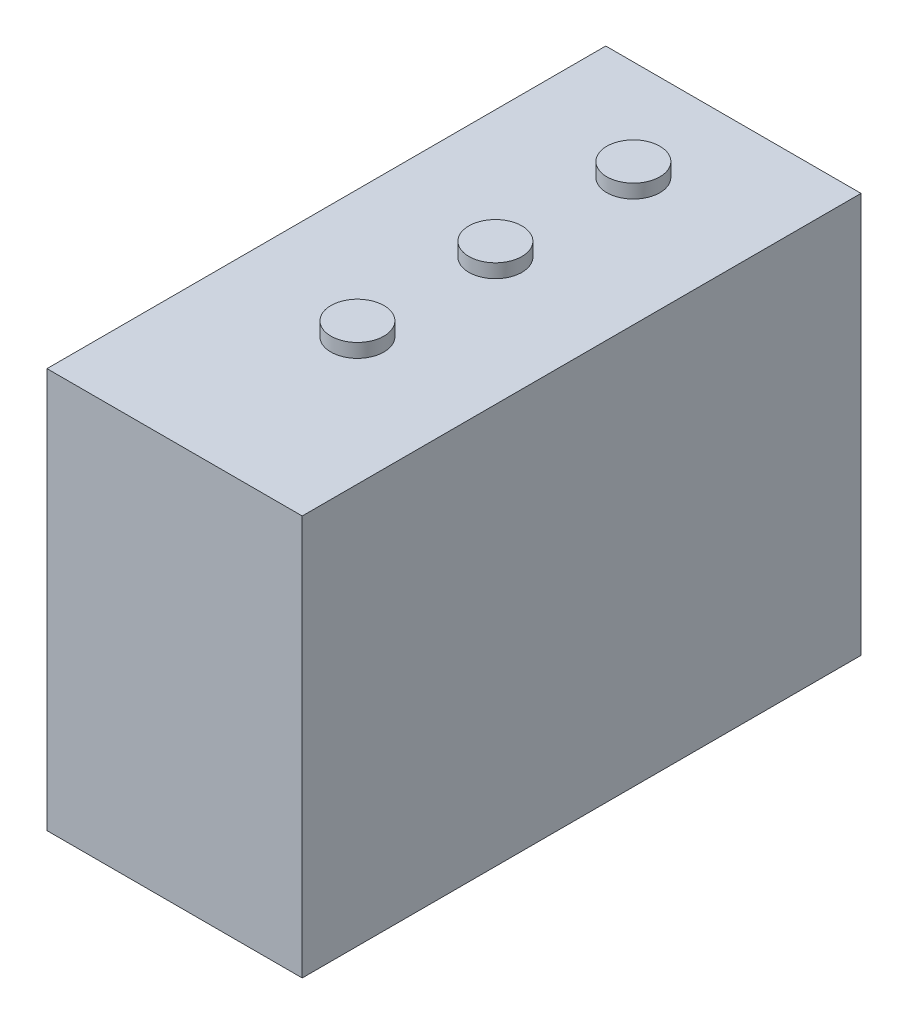
ISO-10303-21;
HEADER;
FILE_DESCRIPTION(('STEP AP214'),'2;1');
FILE_NAME('part.step','',(''),(''),'','','');
FILE_SCHEMA(('AUTOMOTIVE_DESIGN { 1 0 10303 214 1 1 1 1 }'));
ENDSEC;
DATA;
#1=APPLICATION_CONTEXT('core data for automotive mechanical design processes');
#2=APPLICATION_PROTOCOL_DEFINITION('international standard','automotive_design',2000,#1);
#3=PRODUCT_CONTEXT('',#1,'mechanical');
#4=PRODUCT('Part','Part','',(#3));
#5=PRODUCT_RELATED_PRODUCT_CATEGORY('part','',(#4));
#6=PRODUCT_DEFINITION_FORMATION('','',#4);
#7=PRODUCT_DEFINITION_CONTEXT('part definition',#1,'design');
#8=PRODUCT_DEFINITION('design','',#6,#7);
#9=PRODUCT_DEFINITION_SHAPE('','',#8);
#10=(LENGTH_UNIT() NAMED_UNIT(*) SI_UNIT(.MILLI.,.METRE.));
#11=(NAMED_UNIT(*) PLANE_ANGLE_UNIT() SI_UNIT($,.RADIAN.));
#12=(NAMED_UNIT(*) SI_UNIT($,.STERADIAN.) SOLID_ANGLE_UNIT());
#13=UNCERTAINTY_MEASURE_WITH_UNIT(LENGTH_MEASURE(1.E-05),#10,'distance_accuracy_value','');
#14=(GEOMETRIC_REPRESENTATION_CONTEXT(3) GLOBAL_UNCERTAINTY_ASSIGNED_CONTEXT((#13)) GLOBAL_UNIT_ASSIGNED_CONTEXT((#10,
#11,#12)) REPRESENTATION_CONTEXT('',''));
#15=CARTESIAN_POINT('',(0.,0.,0.));
#16=DIRECTION('',(0.,0.,1.));
#17=DIRECTION('',(1.,0.,0.));
#18=AXIS2_PLACEMENT_3D('',#15,#16,#17);
#19=CARTESIAN_POINT('',(18.5,29.,81.));
#20=DIRECTION('',(-1.,0.,0.));
#21=DIRECTION('',(0.,-1.,0.));
#22=AXIS2_PLACEMENT_3D('',#19,#20,#21);
#23=PLANE('',#22);
#24=DIRECTION('',(0.,1.,0.));
#25=VECTOR('',#24,1.);
#26=CARTESIAN_POINT('',(18.5,29.,0.));
#27=LINE('',#26,#25);
#28=CARTESIAN_POINT('',(18.5,-29.,0.));
#29=VERTEX_POINT('',#28);
#30=CARTESIAN_POINT('',(18.5,29.,0.));
#31=VERTEX_POINT('',#30);
#32=EDGE_CURVE('E103',#29,#31,#27,.T.);
#33=ORIENTED_EDGE('',*,*,#32,.T.);
#34=DIRECTION('',(0.,0.,-1.));
#35=VECTOR('',#34,1.);
#36=CARTESIAN_POINT('',(18.5,29.,81.));
#37=LINE('',#36,#35);
#38=CARTESIAN_POINT('',(18.5,29.,81.));
#39=VERTEX_POINT('',#38);
#40=EDGE_CURVE('E94',#39,#31,#37,.T.);
#41=ORIENTED_EDGE('',*,*,#40,.F.);
#42=DIRECTION('',(0.,1.,0.));
#43=VECTOR('',#42,1.);
#44=CARTESIAN_POINT('',(18.5,29.,81.));
#45=LINE('',#44,#43);
#46=CARTESIAN_POINT('',(18.5,-29.,81.));
#47=VERTEX_POINT('',#46);
#48=EDGE_CURVE('E88',#47,#39,#45,.T.);
#49=ORIENTED_EDGE('',*,*,#48,.F.);
#50=DIRECTION('',(0.,0.,-1.));
#51=VECTOR('',#50,1.);
#52=CARTESIAN_POINT('',(18.5,-29.,81.));
#53=LINE('',#52,#51);
#54=EDGE_CURVE('E99',#47,#29,#53,.T.);
#55=ORIENTED_EDGE('',*,*,#54,.T.);
#56=EDGE_LOOP('',(#33,#41,#49,#55));
#57=FACE_BOUND('',#56,.T.);
#58=ADVANCED_FACE('F36',(#57),#23,.F.);
#59=CARTESIAN_POINT('',(-18.5,29.,81.));
#60=DIRECTION('',(0.,-1.,0.));
#61=DIRECTION('',(0.,0.,-1.));
#62=AXIS2_PLACEMENT_3D('',#59,#60,#61);
#63=PLANE('',#62);
#64=CARTESIAN_POINT('',(4.16528467062881E-13,29.,54.5002828646277));
#65=DIRECTION('',(0.,-1.,0.));
#66=DIRECTION('',(0.,0.,-1.));
#67=AXIS2_PLACEMENT_3D('',#64,#65,#66);
#68=CIRCLE('',#67,3.84272757921659);
#69=CARTESIAN_POINT('',(4.16528467062881E-13,29.,50.6575552854111));
#70=VERTEX_POINT('',#69);
#71=EDGE_CURVE('E11',#70,#70,#68,.F.);
#72=ORIENTED_EDGE('',*,*,#71,.F.);
#73=EDGE_LOOP('',(#72));
#74=FACE_BOUND('',#73,.T.);
#75=CARTESIAN_POINT('',(2.08264233531441E-13,29.,34.5002828646277));
#76=DIRECTION('',(0.,-1.,0.));
#77=DIRECTION('',(0.,0.,-1.));
#78=AXIS2_PLACEMENT_3D('',#75,#76,#77);
#79=CIRCLE('',#78,3.84272757921659);
#80=CARTESIAN_POINT('',(2.08264233531441E-13,29.,30.6575552854111));
#81=VERTEX_POINT('',#80);
#82=EDGE_CURVE('E44',#81,#81,#79,.F.);
#83=ORIENTED_EDGE('',*,*,#82,.F.);
#84=EDGE_LOOP('',(#83));
#85=FACE_BOUND('',#84,.T.);
#86=CARTESIAN_POINT('',(0.,29.,14.5002828646277));
#87=DIRECTION('',(0.,-1.,0.));
#88=DIRECTION('',(0.,0.,-1.));
#89=AXIS2_PLACEMENT_3D('',#86,#87,#88);
#90=CIRCLE('',#89,3.84272757921659);
#91=CARTESIAN_POINT('',(0.,29.,10.6575552854111));
#92=VERTEX_POINT('',#91);
#93=EDGE_CURVE('E113',#92,#92,#90,.F.);
#94=ORIENTED_EDGE('',*,*,#93,.F.);
#95=EDGE_LOOP('',(#94));
#96=FACE_BOUND('',#95,.T.);
#97=DIRECTION('',(-1.,0.,0.));
#98=VECTOR('',#97,1.);
#99=CARTESIAN_POINT('',(-18.5,29.,0.));
#100=LINE('',#99,#98);
#101=CARTESIAN_POINT('',(-18.5,29.,0.));
#102=VERTEX_POINT('',#101);
#103=EDGE_CURVE('E93',#31,#102,#100,.T.);
#104=ORIENTED_EDGE('',*,*,#103,.T.);
#105=DIRECTION('',(0.,0.,-1.));
#106=VECTOR('',#105,1.);
#107=CARTESIAN_POINT('',(-18.5,29.,81.));
#108=LINE('',#107,#106);
#109=CARTESIAN_POINT('',(-18.5,29.,81.));
#110=VERTEX_POINT('',#109);
#111=EDGE_CURVE('E91',#110,#102,#108,.T.);
#112=ORIENTED_EDGE('',*,*,#111,.F.);
#113=DIRECTION('',(-1.,0.,0.));
#114=VECTOR('',#113,1.);
#115=CARTESIAN_POINT('',(-18.5,29.,81.));
#116=LINE('',#115,#114);
#117=EDGE_CURVE('E83',#39,#110,#116,.T.);
#118=ORIENTED_EDGE('',*,*,#117,.F.);
#119=ORIENTED_EDGE('',*,*,#40,.T.);
#120=EDGE_LOOP('',(#104,#112,#118,#119));
#121=FACE_BOUND('',#120,.T.);
#122=ADVANCED_FACE('F92',(#74,#85,#96,#121),#63,.F.);
#123=CARTESIAN_POINT('',(-18.5,29.,81.));
#124=DIRECTION('',(1.,0.,0.));
#125=DIRECTION('',(0.,1.,0.));
#126=AXIS2_PLACEMENT_3D('',#123,#124,#125);
#127=PLANE('',#126);
#128=DIRECTION('',(0.,-1.,0.));
#129=VECTOR('',#128,1.);
#130=CARTESIAN_POINT('',(-18.5,29.,0.));
#131=LINE('',#130,#129);
#132=CARTESIAN_POINT('',(-18.5,-29.,0.));
#133=VERTEX_POINT('',#132);
#134=EDGE_CURVE('E69',#102,#133,#131,.T.);
#135=ORIENTED_EDGE('',*,*,#134,.T.);
#136=DIRECTION('',(0.,0.,-1.));
#137=VECTOR('',#136,1.);
#138=CARTESIAN_POINT('',(-18.5,-29.,81.));
#139=LINE('',#138,#137);
#140=CARTESIAN_POINT('',(-18.5,-29.,81.));
#141=VERTEX_POINT('',#140);
#142=EDGE_CURVE('E95',#141,#133,#139,.T.);
#143=ORIENTED_EDGE('',*,*,#142,.F.);
#144=DIRECTION('',(0.,-1.,0.));
#145=VECTOR('',#144,1.);
#146=CARTESIAN_POINT('',(-18.5,29.,81.));
#147=LINE('',#146,#145);
#148=EDGE_CURVE('E86',#110,#141,#147,.T.);
#149=ORIENTED_EDGE('',*,*,#148,.F.);
#150=ORIENTED_EDGE('',*,*,#111,.T.);
#151=EDGE_LOOP('',(#135,#143,#149,#150));
#152=FACE_BOUND('',#151,.T.);
#153=ADVANCED_FACE('F97',(#152),#127,.F.);
#154=CARTESIAN_POINT('',(-18.5,-29.,81.));
#155=DIRECTION('',(0.,1.,0.));
#156=DIRECTION('',(0.,0.,1.));
#157=AXIS2_PLACEMENT_3D('',#154,#155,#156);
#158=PLANE('',#157);
#159=DIRECTION('',(1.,0.,0.));
#160=VECTOR('',#159,1.);
#161=CARTESIAN_POINT('',(-18.5,-29.,0.));
#162=LINE('',#161,#160);
#163=EDGE_CURVE('E75',#133,#29,#162,.T.);
#164=ORIENTED_EDGE('',*,*,#163,.T.);
#165=ORIENTED_EDGE('',*,*,#54,.F.);
#166=DIRECTION('',(1.,0.,0.));
#167=VECTOR('',#166,1.);
#168=CARTESIAN_POINT('',(-18.5,-29.,81.));
#169=LINE('',#168,#167);
#170=EDGE_CURVE('E52',#141,#47,#169,.T.);
#171=ORIENTED_EDGE('',*,*,#170,.F.);
#172=ORIENTED_EDGE('',*,*,#142,.T.);
#173=EDGE_LOOP('',(#164,#165,#171,#172));
#174=FACE_BOUND('',#173,.T.);
#175=ADVANCED_FACE('F146',(#174),#158,.F.);
#176=CARTESIAN_POINT('',(0.,0.,81.));
#177=DIRECTION('',(0.,0.,1.));
#178=DIRECTION('',(1.,0.,0.));
#179=AXIS2_PLACEMENT_3D('',#176,#177,#178);
#180=PLANE('',#179);
#181=ORIENTED_EDGE('',*,*,#48,.T.);
#182=ORIENTED_EDGE('',*,*,#117,.T.);
#183=ORIENTED_EDGE('',*,*,#148,.T.);
#184=ORIENTED_EDGE('',*,*,#170,.T.);
#185=EDGE_LOOP('',(#181,#182,#183,#184));
#186=FACE_BOUND('',#185,.T.);
#187=ADVANCED_FACE('F84',(#186),#180,.T.);
#188=CARTESIAN_POINT('',(0.,0.,0.));
#189=DIRECTION('',(0.,0.,1.));
#190=DIRECTION('',(1.,0.,0.));
#191=AXIS2_PLACEMENT_3D('',#188,#189,#190);
#192=PLANE('',#191);
#193=ORIENTED_EDGE('',*,*,#32,.F.);
#194=ORIENTED_EDGE('',*,*,#163,.F.);
#195=ORIENTED_EDGE('',*,*,#134,.F.);
#196=ORIENTED_EDGE('',*,*,#103,.F.);
#197=EDGE_LOOP('',(#193,#194,#195,#196));
#198=FACE_BOUND('',#197,.T.);
#199=ADVANCED_FACE('F128',(#198),#192,.F.);
#200=CARTESIAN_POINT('',(0.,31.,14.5002828646277));
#201=DIRECTION('',(0.,-1.,0.));
#202=DIRECTION('',(0.,0.,-1.));
#203=AXIS2_PLACEMENT_3D('',#200,#201,#202);
#204=CYLINDRICAL_SURFACE('',#203,3.84272757921659);
#205=CARTESIAN_POINT('',(0.,31.,14.5002828646277));
#206=DIRECTION('',(0.,1.,0.));
#207=DIRECTION('',(0.,0.,1.));
#208=AXIS2_PLACEMENT_3D('',#205,#206,#207);
#209=CIRCLE('',#208,3.84272757921659);
#210=CARTESIAN_POINT('',(0.,31.,18.3430104438443));
#211=VERTEX_POINT('',#210);
#212=EDGE_CURVE('E106',#211,#211,#209,.T.);
#213=ORIENTED_EDGE('',*,*,#212,.F.);
#214=EDGE_LOOP('',(#213));
#215=FACE_BOUND('',#214,.T.);
#216=ORIENTED_EDGE('',*,*,#93,.T.);
#217=EDGE_LOOP('',(#216));
#218=FACE_BOUND('',#217,.T.);
#219=ADVANCED_FACE('F125',(#215,#218),#204,.T.);
#220=CARTESIAN_POINT('',(0.,31.,14.5002828646277));
#221=DIRECTION('',(0.,1.,0.));
#222=DIRECTION('',(0.,0.,1.));
#223=AXIS2_PLACEMENT_3D('',#220,#221,#222);
#224=PLANE('',#223);
#225=ORIENTED_EDGE('',*,*,#212,.T.);
#226=EDGE_LOOP('',(#225));
#227=FACE_BOUND('',#226,.T.);
#228=ADVANCED_FACE('F127',(#227),#224,.T.);
#229=CARTESIAN_POINT('',(2.08264233531441E-13,31.,34.5002828646277));
#230=DIRECTION('',(0.,-1.,0.));
#231=DIRECTION('',(0.,0.,-1.));
#232=AXIS2_PLACEMENT_3D('',#229,#230,#231);
#233=CYLINDRICAL_SURFACE('',#232,3.84272757921659);
#234=CARTESIAN_POINT('',(2.08264233531441E-13,31.,34.5002828646277));
#235=DIRECTION('',(0.,1.,0.));
#236=DIRECTION('',(0.,0.,1.));
#237=AXIS2_PLACEMENT_3D('',#234,#235,#236);
#238=CIRCLE('',#237,3.84272757921659);
#239=CARTESIAN_POINT('',(2.08264233531441E-13,31.,38.3430104438443));
#240=VERTEX_POINT('',#239);
#241=EDGE_CURVE('E223',#240,#240,#238,.T.);
#242=ORIENTED_EDGE('',*,*,#241,.F.);
#243=EDGE_LOOP('',(#242));
#244=FACE_BOUND('',#243,.T.);
#245=ORIENTED_EDGE('',*,*,#82,.T.);
#246=EDGE_LOOP('',(#245));
#247=FACE_BOUND('',#246,.T.);
#248=ADVANCED_FACE('F118',(#244,#247),#233,.T.);
#249=CARTESIAN_POINT('',(2.08264233531441E-13,31.,34.5002828646277));
#250=DIRECTION('',(0.,1.,0.));
#251=DIRECTION('',(0.,0.,1.));
#252=AXIS2_PLACEMENT_3D('',#249,#250,#251);
#253=PLANE('',#252);
#254=ORIENTED_EDGE('',*,*,#241,.T.);
#255=EDGE_LOOP('',(#254));
#256=FACE_BOUND('',#255,.T.);
#257=ADVANCED_FACE('F184',(#256),#253,.T.);
#258=CARTESIAN_POINT('',(4.16528467062881E-13,31.,54.5002828646277));
#259=DIRECTION('',(0.,-1.,0.));
#260=DIRECTION('',(0.,0.,-1.));
#261=AXIS2_PLACEMENT_3D('',#258,#259,#260);
#262=CYLINDRICAL_SURFACE('',#261,3.84272757921659);
#263=CARTESIAN_POINT('',(4.16528467062881E-13,31.,54.5002828646277));
#264=DIRECTION('',(0.,1.,0.));
#265=DIRECTION('',(0.,0.,1.));
#266=AXIS2_PLACEMENT_3D('',#263,#264,#265);
#267=CIRCLE('',#266,3.84272757921659);
#268=CARTESIAN_POINT('',(4.16528467062881E-13,31.,58.3430104438443));
#269=VERTEX_POINT('',#268);
#270=EDGE_CURVE('E222',#269,#269,#267,.T.);
#271=ORIENTED_EDGE('',*,*,#270,.F.);
#272=EDGE_LOOP('',(#271));
#273=FACE_BOUND('',#272,.T.);
#274=ORIENTED_EDGE('',*,*,#71,.T.);
#275=EDGE_LOOP('',(#274));
#276=FACE_BOUND('',#275,.T.);
#277=ADVANCED_FACE('F194',(#273,#276),#262,.T.);
#278=CARTESIAN_POINT('',(4.16528467062881E-13,31.,54.5002828646277));
#279=DIRECTION('',(0.,1.,0.));
#280=DIRECTION('',(0.,0.,1.));
#281=AXIS2_PLACEMENT_3D('',#278,#279,#280);
#282=PLANE('',#281);
#283=ORIENTED_EDGE('',*,*,#270,.T.);
#284=EDGE_LOOP('',(#283));
#285=FACE_BOUND('',#284,.T.);
#286=ADVANCED_FACE('F204',(#285),#282,.T.);
#287=CLOSED_SHELL('',(#58,#122,#153,#175,#187,#199,#219,#228,#248,#257,#277,#286));
#288=MANIFOLD_SOLID_BREP('B2',#287);
#289=ADVANCED_BREP_SHAPE_REPRESENTATION('',(#18,#288),#14);
#290=SHAPE_DEFINITION_REPRESENTATION(#9,#289);
ENDSEC;
END-ISO-10303-21;
